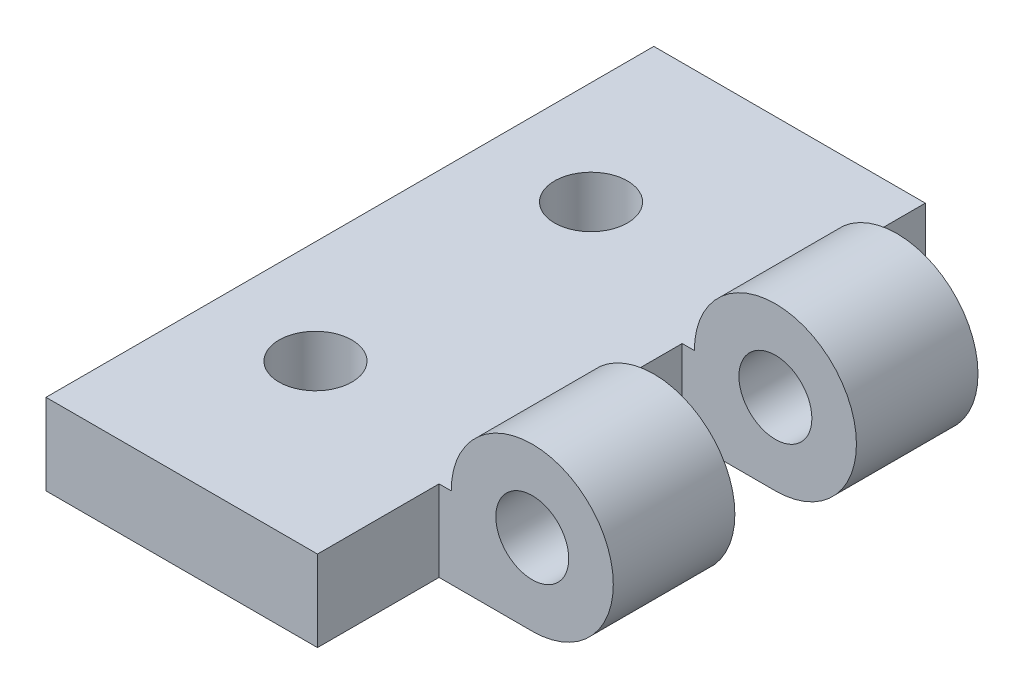
ISO-10303-21;
HEADER;
FILE_DESCRIPTION(('STEP AP214'),'2;1');
FILE_NAME('part.step','',(''),(''),'','','');
FILE_SCHEMA(('AUTOMOTIVE_DESIGN { 1 0 10303 214 1 1 1 1 }'));
ENDSEC;
DATA;
#1=APPLICATION_CONTEXT('core data for automotive mechanical design processes');
#2=APPLICATION_PROTOCOL_DEFINITION('international standard','automotive_design',2000,#1);
#3=PRODUCT_CONTEXT('',#1,'mechanical');
#4=PRODUCT('Part','Part','',(#3));
#5=PRODUCT_RELATED_PRODUCT_CATEGORY('part','',(#4));
#6=PRODUCT_DEFINITION_FORMATION('','',#4);
#7=PRODUCT_DEFINITION_CONTEXT('part definition',#1,'design');
#8=PRODUCT_DEFINITION('design','',#6,#7);
#9=PRODUCT_DEFINITION_SHAPE('','',#8);
#10=(LENGTH_UNIT() NAMED_UNIT(*) SI_UNIT(.MILLI.,.METRE.));
#11=(NAMED_UNIT(*) PLANE_ANGLE_UNIT() SI_UNIT($,.RADIAN.));
#12=(NAMED_UNIT(*) SI_UNIT($,.STERADIAN.) SOLID_ANGLE_UNIT());
#13=UNCERTAINTY_MEASURE_WITH_UNIT(LENGTH_MEASURE(1.E-05),#10,'distance_accuracy_value','');
#14=(GEOMETRIC_REPRESENTATION_CONTEXT(3) GLOBAL_UNCERTAINTY_ASSIGNED_CONTEXT((#13)) GLOBAL_UNIT_ASSIGNED_CONTEXT((#10,
#11,#12)) REPRESENTATION_CONTEXT('',''));
#15=CARTESIAN_POINT('',(0.,0.,0.));
#16=DIRECTION('',(0.,0.,1.));
#17=DIRECTION('',(1.,0.,0.));
#18=AXIS2_PLACEMENT_3D('',#15,#16,#17);
#19=CARTESIAN_POINT('',(22.86,5.08,38.1));
#20=DIRECTION('',(0.,0.,-1.));
#21=DIRECTION('',(-1.,0.,0.));
#22=AXIS2_PLACEMENT_3D('',#19,#20,#21);
#23=CYLINDRICAL_SURFACE('',#22,5.08);
#24=DIRECTION('',(0.,0.,-1.));
#25=VECTOR('',#24,1.);
#26=CARTESIAN_POINT('',(17.78,5.08,38.1));
#27=LINE('',#26,#25);
#28=CARTESIAN_POINT('',(17.78,5.08,30.48));
#29=VERTEX_POINT('',#28);
#30=CARTESIAN_POINT('',(17.78,5.08,22.86));
#31=VERTEX_POINT('',#30);
#32=EDGE_CURVE('E222',#29,#31,#27,.T.);
#33=ORIENTED_EDGE('',*,*,#32,.F.);
#34=CARTESIAN_POINT('',(22.86,5.08,30.48));
#35=DIRECTION('',(0.,0.,-1.));
#36=DIRECTION('',(-1.,0.,0.));
#37=AXIS2_PLACEMENT_3D('',#34,#35,#36);
#38=CIRCLE('',#37,5.08);
#39=CARTESIAN_POINT('',(22.86,0.,30.48));
#40=VERTEX_POINT('',#39);
#41=EDGE_CURVE('E187',#29,#40,#38,.T.);
#42=ORIENTED_EDGE('',*,*,#41,.T.);
#43=DIRECTION('',(0.,0.,-1.));
#44=VECTOR('',#43,1.);
#45=CARTESIAN_POINT('',(22.86,0.,38.1));
#46=LINE('',#45,#44);
#47=CARTESIAN_POINT('',(22.86,0.,22.86));
#48=VERTEX_POINT('',#47);
#49=EDGE_CURVE('E225',#40,#48,#46,.T.);
#50=ORIENTED_EDGE('',*,*,#49,.T.);
#51=CARTESIAN_POINT('',(22.86,5.08,22.86));
#52=DIRECTION('',(0.,0.,1.));
#53=DIRECTION('',(1.,0.,0.));
#54=AXIS2_PLACEMENT_3D('',#51,#52,#53);
#55=CIRCLE('',#54,5.08);
#56=EDGE_CURVE('E185',#48,#31,#55,.T.);
#57=ORIENTED_EDGE('',*,*,#56,.T.);
#58=EDGE_LOOP('',(#33,#42,#50,#57));
#59=FACE_BOUND('',#58,.T.);
#60=ADVANCED_FACE('F37',(#59),#23,.T.);
#61=CARTESIAN_POINT('',(0.,0.,38.1));
#62=DIRECTION('',(0.,1.,0.));
#63=DIRECTION('',(0.,0.,1.));
#64=AXIS2_PLACEMENT_3D('',#61,#62,#63);
#65=PLANE('',#64);
#66=CARTESIAN_POINT('',(6.477,0.,10.414));
#67=DIRECTION('',(0.,1.,0.));
#68=DIRECTION('',(0.,0.,1.));
#69=AXIS2_PLACEMENT_3D('',#66,#67,#68);
#70=CIRCLE('',#69,2.286);
#71=CARTESIAN_POINT('',(6.477,0.,12.7));
#72=VERTEX_POINT('',#71);
#73=EDGE_CURVE('E191',#72,#72,#70,.T.);
#74=ORIENTED_EDGE('',*,*,#73,.T.);
#75=EDGE_LOOP('',(#74));
#76=FACE_BOUND('',#75,.T.);
#77=CARTESIAN_POINT('',(6.477,0.,27.686));
#78=DIRECTION('',(0.,1.,0.));
#79=DIRECTION('',(0.,0.,1.));
#80=AXIS2_PLACEMENT_3D('',#77,#78,#79);
#81=CIRCLE('',#80,2.286);
#82=CARTESIAN_POINT('',(6.477,0.,29.972));
#83=VERTEX_POINT('',#82);
#84=EDGE_CURVE('E197',#83,#83,#81,.T.);
#85=ORIENTED_EDGE('',*,*,#84,.T.);
#86=EDGE_LOOP('',(#85));
#87=FACE_BOUND('',#86,.T.);
#88=DIRECTION('',(1.,0.,0.));
#89=VECTOR('',#88,1.);
#90=CARTESIAN_POINT('',(0.,0.,0.));
#91=LINE('',#90,#89);
#92=CARTESIAN_POINT('',(0.,0.,0.));
#93=VERTEX_POINT('',#92);
#94=CARTESIAN_POINT('',(17.018,0.,0.));
#95=VERTEX_POINT('',#94);
#96=EDGE_CURVE('E150',#93,#95,#91,.T.);
#97=ORIENTED_EDGE('',*,*,#96,.T.);
#98=DIRECTION('',(0.,0.,1.));
#99=VECTOR('',#98,1.);
#100=CARTESIAN_POINT('',(17.018,0.,0.));
#101=LINE('',#100,#99);
#102=CARTESIAN_POINT('',(17.018,0.,7.62));
#103=VERTEX_POINT('',#102);
#104=EDGE_CURVE('E131',#95,#103,#101,.T.);
#105=ORIENTED_EDGE('',*,*,#104,.T.);
#106=DIRECTION('',(1.,0.,0.));
#107=VECTOR('',#106,1.);
#108=CARTESIAN_POINT('',(17.018,0.,7.62));
#109=LINE('',#108,#107);
#110=CARTESIAN_POINT('',(22.86,0.,7.62));
#111=VERTEX_POINT('',#110);
#112=EDGE_CURVE('E138',#103,#111,#109,.T.);
#113=ORIENTED_EDGE('',*,*,#112,.T.);
#114=CARTESIAN_POINT('',(22.86,0.,15.24));
#115=VERTEX_POINT('',#114);
#116=EDGE_CURVE('E223',#115,#111,#46,.T.);
#117=ORIENTED_EDGE('',*,*,#116,.F.);
#118=DIRECTION('',(-1.,0.,0.));
#119=VECTOR('',#118,1.);
#120=CARTESIAN_POINT('',(27.94,0.,15.24));
#121=LINE('',#120,#119);
#122=CARTESIAN_POINT('',(17.018,0.,15.24));
#123=VERTEX_POINT('',#122);
#124=EDGE_CURVE('E168',#115,#123,#121,.T.);
#125=ORIENTED_EDGE('',*,*,#124,.T.);
#126=DIRECTION('',(0.,0.,1.));
#127=VECTOR('',#126,1.);
#128=CARTESIAN_POINT('',(17.018,0.,22.86));
#129=LINE('',#128,#127);
#130=CARTESIAN_POINT('',(17.018,0.,22.86));
#131=VERTEX_POINT('',#130);
#132=EDGE_CURVE('E171',#123,#131,#129,.T.);
#133=ORIENTED_EDGE('',*,*,#132,.T.);
#134=DIRECTION('',(1.,0.,0.));
#135=VECTOR('',#134,1.);
#136=CARTESIAN_POINT('',(27.94,0.,22.86));
#137=LINE('',#136,#135);
#138=EDGE_CURVE('E174',#131,#48,#137,.T.);
#139=ORIENTED_EDGE('',*,*,#138,.T.);
#140=ORIENTED_EDGE('',*,*,#49,.F.);
#141=DIRECTION('',(-1.,0.,0.));
#142=VECTOR('',#141,1.);
#143=CARTESIAN_POINT('',(27.94,0.,30.48));
#144=LINE('',#143,#142);
#145=CARTESIAN_POINT('',(17.018,0.,30.48));
#146=VERTEX_POINT('',#145);
#147=EDGE_CURVE('E160',#40,#146,#144,.T.);
#148=ORIENTED_EDGE('',*,*,#147,.T.);
#149=DIRECTION('',(0.,0.,1.));
#150=VECTOR('',#149,1.);
#151=CARTESIAN_POINT('',(17.018,0.,38.1));
#152=LINE('',#151,#150);
#153=CARTESIAN_POINT('',(17.018,0.,38.1));
#154=VERTEX_POINT('',#153);
#155=EDGE_CURVE('E163',#146,#154,#152,.T.);
#156=ORIENTED_EDGE('',*,*,#155,.T.);
#157=DIRECTION('',(1.,0.,0.));
#158=VECTOR('',#157,1.);
#159=CARTESIAN_POINT('',(0.,0.,38.1));
#160=LINE('',#159,#158);
#161=CARTESIAN_POINT('',(0.,0.,38.1));
#162=VERTEX_POINT('',#161);
#163=EDGE_CURVE('E202',#162,#154,#160,.T.);
#164=ORIENTED_EDGE('',*,*,#163,.F.);
#165=DIRECTION('',(0.,0.,-1.));
#166=VECTOR('',#165,1.);
#167=CARTESIAN_POINT('',(0.,0.,38.1));
#168=LINE('',#167,#166);
#169=EDGE_CURVE('E210',#162,#93,#168,.T.);
#170=ORIENTED_EDGE('',*,*,#169,.T.);
#171=EDGE_LOOP('',(#97,#105,#113,#117,#125,#133,#139,#140,#148,#156,#164,#170));
#172=FACE_BOUND('',#171,.T.);
#173=ADVANCED_FACE('F39',(#76,#87,#172),#65,.F.);
#174=CARTESIAN_POINT('',(22.86,5.08,7.62));
#175=DIRECTION('',(0.,0.,1.));
#176=DIRECTION('',(1.,0.,0.));
#177=AXIS2_PLACEMENT_3D('',#174,#175,#176);
#178=CIRCLE('',#177,5.08);
#179=CARTESIAN_POINT('',(17.78,5.08,7.62));
#180=VERTEX_POINT('',#179);
#181=EDGE_CURVE('E142',#111,#180,#178,.T.);
#182=ORIENTED_EDGE('',*,*,#181,.T.);
#183=CARTESIAN_POINT('',(17.78,5.08,15.24));
#184=VERTEX_POINT('',#183);
#185=EDGE_CURVE('E219',#184,#180,#27,.T.);
#186=ORIENTED_EDGE('',*,*,#185,.F.);
#187=CARTESIAN_POINT('',(22.86,5.08,15.24));
#188=DIRECTION('',(0.,0.,-1.));
#189=DIRECTION('',(-1.,0.,0.));
#190=AXIS2_PLACEMENT_3D('',#187,#188,#189);
#191=CIRCLE('',#190,5.08);
#192=EDGE_CURVE('E53',#184,#115,#191,.T.);
#193=ORIENTED_EDGE('',*,*,#192,.T.);
#194=ORIENTED_EDGE('',*,*,#116,.T.);
#195=EDGE_LOOP('',(#182,#186,#193,#194));
#196=FACE_BOUND('',#195,.T.);
#197=ADVANCED_FACE('F255',(#196),#23,.T.);
#198=CARTESIAN_POINT('',(0.,5.08,38.1));
#199=DIRECTION('',(0.,-1.,0.));
#200=DIRECTION('',(0.,0.,-1.));
#201=AXIS2_PLACEMENT_3D('',#198,#199,#200);
#202=PLANE('',#201);
#203=CARTESIAN_POINT('',(6.477,5.08,10.414));
#204=DIRECTION('',(0.,1.,0.));
#205=DIRECTION('',(0.,0.,1.));
#206=AXIS2_PLACEMENT_3D('',#203,#204,#205);
#207=CIRCLE('',#206,2.286);
#208=CARTESIAN_POINT('',(6.477,5.08,12.7));
#209=VERTEX_POINT('',#208);
#210=EDGE_CURVE('E194',#209,#209,#207,.T.);
#211=ORIENTED_EDGE('',*,*,#210,.F.);
#212=EDGE_LOOP('',(#211));
#213=FACE_BOUND('',#212,.T.);
#214=CARTESIAN_POINT('',(6.477,5.08,27.686));
#215=DIRECTION('',(0.,1.,0.));
#216=DIRECTION('',(0.,0.,1.));
#217=AXIS2_PLACEMENT_3D('',#214,#215,#216);
#218=CIRCLE('',#217,2.286);
#219=CARTESIAN_POINT('',(6.477,5.08,29.972));
#220=VERTEX_POINT('',#219);
#221=EDGE_CURVE('E190',#220,#220,#218,.T.);
#222=ORIENTED_EDGE('',*,*,#221,.F.);
#223=EDGE_LOOP('',(#222));
#224=FACE_BOUND('',#223,.T.);
#225=DIRECTION('',(-1.,0.,0.));
#226=VECTOR('',#225,1.);
#227=CARTESIAN_POINT('',(0.,5.08,7.62));
#228=LINE('',#227,#226);
#229=CARTESIAN_POINT('',(17.018,5.08,7.62));
#230=VERTEX_POINT('',#229);
#231=EDGE_CURVE('E11',#180,#230,#228,.T.);
#232=ORIENTED_EDGE('',*,*,#231,.T.);
#233=DIRECTION('',(0.,0.,-1.));
#234=VECTOR('',#233,1.);
#235=CARTESIAN_POINT('',(17.018,5.08,38.1));
#236=LINE('',#235,#234);
#237=CARTESIAN_POINT('',(17.018,5.08,0.));
#238=VERTEX_POINT('',#237);
#239=EDGE_CURVE('E134',#230,#238,#236,.T.);
#240=ORIENTED_EDGE('',*,*,#239,.T.);
#241=DIRECTION('',(-1.,0.,0.));
#242=VECTOR('',#241,1.);
#243=CARTESIAN_POINT('',(0.,5.08,0.));
#244=LINE('',#243,#242);
#245=CARTESIAN_POINT('',(0.,5.08,0.));
#246=VERTEX_POINT('',#245);
#247=EDGE_CURVE('E212',#238,#246,#244,.T.);
#248=ORIENTED_EDGE('',*,*,#247,.T.);
#249=DIRECTION('',(0.,0.,-1.));
#250=VECTOR('',#249,1.);
#251=CARTESIAN_POINT('',(0.,5.08,38.1));
#252=LINE('',#251,#250);
#253=CARTESIAN_POINT('',(0.,5.08,38.1));
#254=VERTEX_POINT('',#253);
#255=EDGE_CURVE('E216',#254,#246,#252,.T.);
#256=ORIENTED_EDGE('',*,*,#255,.F.);
#257=DIRECTION('',(-1.,0.,0.));
#258=VECTOR('',#257,1.);
#259=CARTESIAN_POINT('',(0.,5.08,38.1));
#260=LINE('',#259,#258);
#261=CARTESIAN_POINT('',(17.018,5.08,38.1));
#262=VERTEX_POINT('',#261);
#263=EDGE_CURVE('E205',#262,#254,#260,.T.);
#264=ORIENTED_EDGE('',*,*,#263,.F.);
#265=DIRECTION('',(0.,0.,-1.));
#266=VECTOR('',#265,1.);
#267=CARTESIAN_POINT('',(17.018,5.08,38.1));
#268=LINE('',#267,#266);
#269=CARTESIAN_POINT('',(17.018,5.08,30.48));
#270=VERTEX_POINT('',#269);
#271=EDGE_CURVE('E61',#262,#270,#268,.T.);
#272=ORIENTED_EDGE('',*,*,#271,.T.);
#273=DIRECTION('',(1.,0.,0.));
#274=VECTOR('',#273,1.);
#275=CARTESIAN_POINT('',(0.,5.08,30.48));
#276=LINE('',#275,#274);
#277=EDGE_CURVE('E46',#270,#29,#276,.T.);
#278=ORIENTED_EDGE('',*,*,#277,.T.);
#279=ORIENTED_EDGE('',*,*,#32,.T.);
#280=DIRECTION('',(-1.,0.,0.));
#281=VECTOR('',#280,1.);
#282=CARTESIAN_POINT('',(0.,5.08,22.86));
#283=LINE('',#282,#281);
#284=CARTESIAN_POINT('',(17.018,5.08,22.86));
#285=VERTEX_POINT('',#284);
#286=EDGE_CURVE('E231',#31,#285,#283,.T.);
#287=ORIENTED_EDGE('',*,*,#286,.T.);
#288=DIRECTION('',(0.,0.,-1.));
#289=VECTOR('',#288,1.);
#290=CARTESIAN_POINT('',(17.018,5.08,38.1));
#291=LINE('',#290,#289);
#292=CARTESIAN_POINT('',(17.018,5.08,15.24));
#293=VERTEX_POINT('',#292);
#294=EDGE_CURVE('E228',#285,#293,#291,.T.);
#295=ORIENTED_EDGE('',*,*,#294,.T.);
#296=DIRECTION('',(1.,0.,0.));
#297=VECTOR('',#296,1.);
#298=CARTESIAN_POINT('',(0.,5.08,15.24));
#299=LINE('',#298,#297);
#300=EDGE_CURVE('E226',#293,#184,#299,.T.);
#301=ORIENTED_EDGE('',*,*,#300,.T.);
#302=ORIENTED_EDGE('',*,*,#185,.T.);
#303=EDGE_LOOP('',(#232,#240,#248,#256,#264,#272,#278,#279,#287,#295,#301,#302));
#304=FACE_BOUND('',#303,.T.);
#305=ADVANCED_FACE('F238',(#213,#224,#304),#202,.F.);
#306=CARTESIAN_POINT('',(0.,0.,38.1));
#307=DIRECTION('',(1.,0.,0.));
#308=DIRECTION('',(0.,0.,-1.));
#309=AXIS2_PLACEMENT_3D('',#306,#307,#308);
#310=PLANE('',#309);
#311=DIRECTION('',(0.,-1.,0.));
#312=VECTOR('',#311,1.);
#313=CARTESIAN_POINT('',(0.,0.,0.));
#314=LINE('',#313,#312);
#315=EDGE_CURVE('E206',#246,#93,#314,.T.);
#316=ORIENTED_EDGE('',*,*,#315,.T.);
#317=ORIENTED_EDGE('',*,*,#169,.F.);
#318=DIRECTION('',(0.,-1.,0.));
#319=VECTOR('',#318,1.);
#320=CARTESIAN_POINT('',(0.,0.,38.1));
#321=LINE('',#320,#319);
#322=EDGE_CURVE('E208',#254,#162,#321,.T.);
#323=ORIENTED_EDGE('',*,*,#322,.F.);
#324=ORIENTED_EDGE('',*,*,#255,.T.);
#325=EDGE_LOOP('',(#316,#317,#323,#324));
#326=FACE_BOUND('',#325,.T.);
#327=ADVANCED_FACE('F263',(#326),#310,.F.);
#328=CARTESIAN_POINT('',(22.86,5.08,38.1));
#329=DIRECTION('',(0.,0.,1.));
#330=DIRECTION('',(1.,0.,0.));
#331=AXIS2_PLACEMENT_3D('',#328,#329,#330);
#332=PLANE('',#331);
#333=DIRECTION('',(0.,1.,0.));
#334=VECTOR('',#333,1.);
#335=CARTESIAN_POINT('',(17.018,0.,38.1));
#336=LINE('',#335,#334);
#337=EDGE_CURVE('E151',#154,#262,#336,.T.);
#338=ORIENTED_EDGE('',*,*,#337,.T.);
#339=ORIENTED_EDGE('',*,*,#263,.T.);
#340=ORIENTED_EDGE('',*,*,#322,.T.);
#341=ORIENTED_EDGE('',*,*,#163,.T.);
#342=EDGE_LOOP('',(#338,#339,#340,#341));
#343=FACE_BOUND('',#342,.T.);
#344=ADVANCED_FACE('F268',(#343),#332,.T.);
#345=CARTESIAN_POINT('',(22.86,5.08,0.));
#346=DIRECTION('',(0.,0.,1.));
#347=DIRECTION('',(1.,0.,0.));
#348=AXIS2_PLACEMENT_3D('',#345,#346,#347);
#349=PLANE('',#348);
#350=ORIENTED_EDGE('',*,*,#247,.F.);
#351=DIRECTION('',(0.,1.,0.));
#352=VECTOR('',#351,1.);
#353=CARTESIAN_POINT('',(17.018,0.,0.));
#354=LINE('',#353,#352);
#355=EDGE_CURVE('E137',#95,#238,#354,.T.);
#356=ORIENTED_EDGE('',*,*,#355,.F.);
#357=ORIENTED_EDGE('',*,*,#96,.F.);
#358=ORIENTED_EDGE('',*,*,#315,.F.);
#359=EDGE_LOOP('',(#350,#356,#357,#358));
#360=FACE_BOUND('',#359,.T.);
#361=ADVANCED_FACE('F260',(#360),#349,.F.);
#362=CARTESIAN_POINT('',(6.477,0.,27.686));
#363=DIRECTION('',(0.,1.,0.));
#364=DIRECTION('',(0.,0.,1.));
#365=AXIS2_PLACEMENT_3D('',#362,#363,#364);
#366=CYLINDRICAL_SURFACE('',#365,2.286);
#367=ORIENTED_EDGE('',*,*,#84,.F.);
#368=EDGE_LOOP('',(#367));
#369=FACE_BOUND('',#368,.T.);
#370=ORIENTED_EDGE('',*,*,#221,.T.);
#371=EDGE_LOOP('',(#370));
#372=FACE_BOUND('',#371,.T.);
#373=ADVANCED_FACE('F302',(#369,#372),#366,.F.);
#374=CARTESIAN_POINT('',(6.477,0.,10.414));
#375=DIRECTION('',(0.,1.,0.));
#376=DIRECTION('',(0.,0.,1.));
#377=AXIS2_PLACEMENT_3D('',#374,#375,#376);
#378=CYLINDRICAL_SURFACE('',#377,2.286);
#379=ORIENTED_EDGE('',*,*,#73,.F.);
#380=EDGE_LOOP('',(#379));
#381=FACE_BOUND('',#380,.T.);
#382=ORIENTED_EDGE('',*,*,#210,.T.);
#383=EDGE_LOOP('',(#382));
#384=FACE_BOUND('',#383,.T.);
#385=ADVANCED_FACE('F307',(#381,#384),#378,.F.);
#386=CARTESIAN_POINT('',(17.018,0.,7.62));
#387=DIRECTION('',(0.,0.,1.));
#388=DIRECTION('',(1.,0.,0.));
#389=AXIS2_PLACEMENT_3D('',#386,#387,#388);
#390=PLANE('',#389);
#391=CARTESIAN_POINT('',(22.86,5.08,7.62));
#392=DIRECTION('',(0.,0.,1.));
#393=DIRECTION('',(1.,0.,0.));
#394=AXIS2_PLACEMENT_3D('',#391,#392,#393);
#395=CIRCLE('',#394,2.286);
#396=CARTESIAN_POINT('',(25.146,5.08,7.62));
#397=VERTEX_POINT('',#396);
#398=EDGE_CURVE('E156',#397,#397,#395,.T.);
#399=ORIENTED_EDGE('',*,*,#398,.T.);
#400=EDGE_LOOP('',(#399));
#401=FACE_BOUND('',#400,.T.);
#402=ORIENTED_EDGE('',*,*,#112,.F.);
#403=DIRECTION('',(0.,1.,0.));
#404=VECTOR('',#403,1.);
#405=CARTESIAN_POINT('',(17.018,0.,7.62));
#406=LINE('',#405,#404);
#407=EDGE_CURVE('E127',#103,#230,#406,.T.);
#408=ORIENTED_EDGE('',*,*,#407,.T.);
#409=ORIENTED_EDGE('',*,*,#231,.F.);
#410=ORIENTED_EDGE('',*,*,#181,.F.);
#411=EDGE_LOOP('',(#402,#408,#409,#410));
#412=FACE_BOUND('',#411,.T.);
#413=ADVANCED_FACE('F141',(#401,#412),#390,.F.);
#414=CARTESIAN_POINT('',(17.018,0.,0.));
#415=DIRECTION('',(-1.,0.,0.));
#416=DIRECTION('',(0.,0.,1.));
#417=AXIS2_PLACEMENT_3D('',#414,#415,#416);
#418=PLANE('',#417);
#419=ORIENTED_EDGE('',*,*,#407,.F.);
#420=ORIENTED_EDGE('',*,*,#104,.F.);
#421=ORIENTED_EDGE('',*,*,#355,.T.);
#422=ORIENTED_EDGE('',*,*,#239,.F.);
#423=EDGE_LOOP('',(#419,#420,#421,#422));
#424=FACE_BOUND('',#423,.T.);
#425=ADVANCED_FACE('F129',(#424),#418,.F.);
#426=CARTESIAN_POINT('',(27.94,0.,30.48));
#427=DIRECTION('',(0.,0.,-1.));
#428=DIRECTION('',(-1.,0.,0.));
#429=AXIS2_PLACEMENT_3D('',#426,#427,#428);
#430=PLANE('',#429);
#431=CARTESIAN_POINT('',(22.86,5.08,30.48));
#432=DIRECTION('',(0.,0.,1.));
#433=DIRECTION('',(1.,0.,0.));
#434=AXIS2_PLACEMENT_3D('',#431,#432,#433);
#435=CIRCLE('',#434,2.286);
#436=CARTESIAN_POINT('',(25.146,5.08,30.48));
#437=VERTEX_POINT('',#436);
#438=EDGE_CURVE('E327',#437,#437,#435,.T.);
#439=ORIENTED_EDGE('',*,*,#438,.F.);
#440=EDGE_LOOP('',(#439));
#441=FACE_BOUND('',#440,.T.);
#442=ORIENTED_EDGE('',*,*,#41,.F.);
#443=ORIENTED_EDGE('',*,*,#277,.F.);
#444=DIRECTION('',(0.,1.,0.));
#445=VECTOR('',#444,1.);
#446=CARTESIAN_POINT('',(17.018,0.,30.48));
#447=LINE('',#446,#445);
#448=EDGE_CURVE('E153',#146,#270,#447,.T.);
#449=ORIENTED_EDGE('',*,*,#448,.F.);
#450=ORIENTED_EDGE('',*,*,#147,.F.);
#451=EDGE_LOOP('',(#442,#443,#449,#450));
#452=FACE_BOUND('',#451,.T.);
#453=ADVANCED_FACE('F270',(#441,#452),#430,.F.);
#454=CARTESIAN_POINT('',(17.018,0.,38.1));
#455=DIRECTION('',(-1.,0.,0.));
#456=DIRECTION('',(0.,0.,1.));
#457=AXIS2_PLACEMENT_3D('',#454,#455,#456);
#458=PLANE('',#457);
#459=ORIENTED_EDGE('',*,*,#337,.F.);
#460=ORIENTED_EDGE('',*,*,#155,.F.);
#461=ORIENTED_EDGE('',*,*,#448,.T.);
#462=ORIENTED_EDGE('',*,*,#271,.F.);
#463=EDGE_LOOP('',(#459,#460,#461,#462));
#464=FACE_BOUND('',#463,.T.);
#465=ADVANCED_FACE('F269',(#464),#458,.F.);
#466=CARTESIAN_POINT('',(27.94,0.,22.86));
#467=DIRECTION('',(0.,0.,1.));
#468=DIRECTION('',(1.,0.,0.));
#469=AXIS2_PLACEMENT_3D('',#466,#467,#468);
#470=PLANE('',#469);
#471=CARTESIAN_POINT('',(22.86,5.08,22.86));
#472=DIRECTION('',(0.,0.,1.));
#473=DIRECTION('',(1.,0.,0.));
#474=AXIS2_PLACEMENT_3D('',#471,#472,#473);
#475=CIRCLE('',#474,2.286);
#476=CARTESIAN_POINT('',(25.146,5.08,22.86));
#477=VERTEX_POINT('',#476);
#478=EDGE_CURVE('E323',#477,#477,#475,.T.);
#479=ORIENTED_EDGE('',*,*,#478,.T.);
#480=EDGE_LOOP('',(#479));
#481=FACE_BOUND('',#480,.T.);
#482=ORIENTED_EDGE('',*,*,#138,.F.);
#483=DIRECTION('',(0.,1.,0.));
#484=VECTOR('',#483,1.);
#485=CARTESIAN_POINT('',(17.018,0.,22.86));
#486=LINE('',#485,#484);
#487=EDGE_CURVE('E164',#131,#285,#486,.T.);
#488=ORIENTED_EDGE('',*,*,#487,.T.);
#489=ORIENTED_EDGE('',*,*,#286,.F.);
#490=ORIENTED_EDGE('',*,*,#56,.F.);
#491=EDGE_LOOP('',(#482,#488,#489,#490));
#492=FACE_BOUND('',#491,.T.);
#493=ADVANCED_FACE('F248',(#481,#492),#470,.F.);
#494=CARTESIAN_POINT('',(17.018,0.,22.86));
#495=DIRECTION('',(-1.,0.,0.));
#496=DIRECTION('',(0.,0.,1.));
#497=AXIS2_PLACEMENT_3D('',#494,#495,#496);
#498=PLANE('',#497);
#499=ORIENTED_EDGE('',*,*,#487,.F.);
#500=ORIENTED_EDGE('',*,*,#132,.F.);
#501=DIRECTION('',(0.,1.,0.));
#502=VECTOR('',#501,1.);
#503=CARTESIAN_POINT('',(17.018,0.,15.24));
#504=LINE('',#503,#502);
#505=EDGE_CURVE('E177',#123,#293,#504,.T.);
#506=ORIENTED_EDGE('',*,*,#505,.T.);
#507=ORIENTED_EDGE('',*,*,#294,.F.);
#508=EDGE_LOOP('',(#499,#500,#506,#507));
#509=FACE_BOUND('',#508,.T.);
#510=ADVANCED_FACE('F251',(#509),#498,.F.);
#511=CARTESIAN_POINT('',(27.94,0.,15.24));
#512=DIRECTION('',(0.,0.,-1.));
#513=DIRECTION('',(-1.,0.,0.));
#514=AXIS2_PLACEMENT_3D('',#511,#512,#513);
#515=PLANE('',#514);
#516=CARTESIAN_POINT('',(22.86,5.08,15.24));
#517=DIRECTION('',(0.,0.,-1.));
#518=DIRECTION('',(-1.,0.,0.));
#519=AXIS2_PLACEMENT_3D('',#516,#517,#518);
#520=CIRCLE('',#519,2.286);
#521=CARTESIAN_POINT('',(20.574,5.08,15.24));
#522=VERTEX_POINT('',#521);
#523=EDGE_CURVE('E41',#522,#522,#520,.T.);
#524=ORIENTED_EDGE('',*,*,#523,.T.);
#525=EDGE_LOOP('',(#524));
#526=FACE_BOUND('',#525,.T.);
#527=ORIENTED_EDGE('',*,*,#192,.F.);
#528=ORIENTED_EDGE('',*,*,#300,.F.);
#529=ORIENTED_EDGE('',*,*,#505,.F.);
#530=ORIENTED_EDGE('',*,*,#124,.F.);
#531=EDGE_LOOP('',(#527,#528,#529,#530));
#532=FACE_BOUND('',#531,.T.);
#533=ADVANCED_FACE('F253',(#526,#532),#515,.F.);
#534=CARTESIAN_POINT('',(22.86,5.08,0.));
#535=DIRECTION('',(0.,0.,1.));
#536=DIRECTION('',(1.,0.,0.));
#537=AXIS2_PLACEMENT_3D('',#534,#535,#536);
#538=CYLINDRICAL_SURFACE('',#537,2.286);
#539=ORIENTED_EDGE('',*,*,#523,.F.);
#540=EDGE_LOOP('',(#539));
#541=FACE_BOUND('',#540,.T.);
#542=ORIENTED_EDGE('',*,*,#398,.F.);
#543=EDGE_LOOP('',(#542));
#544=FACE_BOUND('',#543,.T.);
#545=ADVANCED_FACE('F314',(#541,#544),#538,.F.);
#546=ORIENTED_EDGE('',*,*,#438,.T.);
#547=EDGE_LOOP('',(#546));
#548=FACE_BOUND('',#547,.T.);
#549=ORIENTED_EDGE('',*,*,#478,.F.);
#550=EDGE_LOOP('',(#549));
#551=FACE_BOUND('',#550,.T.);
#552=ADVANCED_FACE('F331',(#548,#551),#538,.F.);
#553=CLOSED_SHELL('',(#60,#173,#197,#305,#327,#344,#361,#373,#385,#413,#425,#453,#465,#493,#510,
#533,#545,#552));
#554=MANIFOLD_SOLID_BREP('B2',#553);
#555=ADVANCED_BREP_SHAPE_REPRESENTATION('',(#18,#554),#14);
#556=SHAPE_DEFINITION_REPRESENTATION(#9,#555);
ENDSEC;
END-ISO-10303-21;
